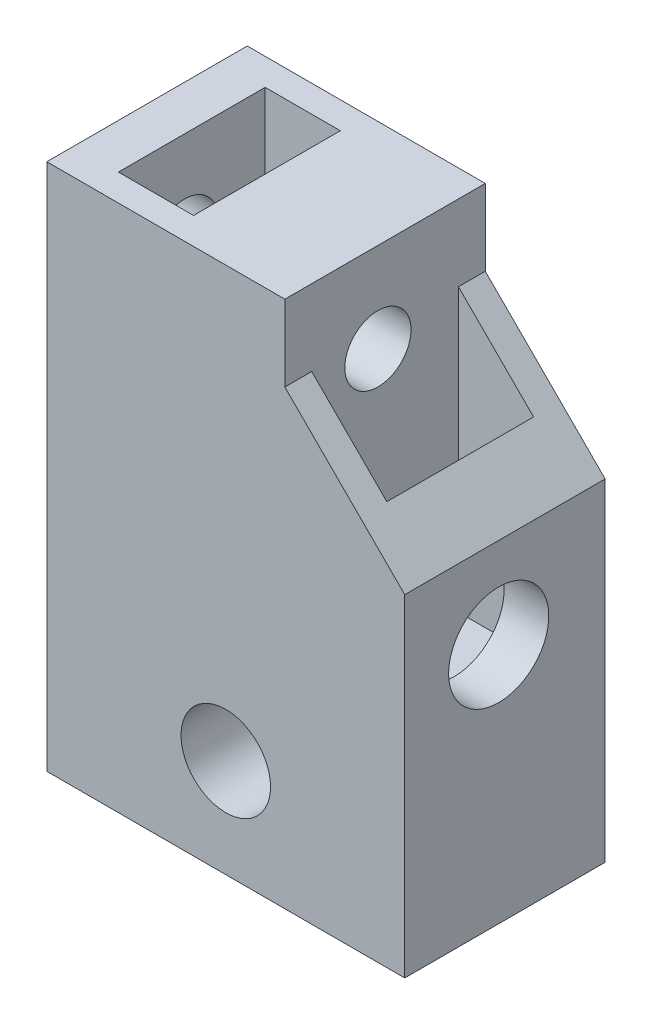
ISO-10303-21;
HEADER;
FILE_DESCRIPTION(('STEP AP214'),'2;1');
FILE_NAME('part.step','',(''),(''),'','','');
FILE_SCHEMA(('AUTOMOTIVE_DESIGN { 1 0 10303 214 1 1 1 1 }'));
ENDSEC;
DATA;
#1=APPLICATION_CONTEXT('core data for automotive mechanical design processes');
#2=APPLICATION_PROTOCOL_DEFINITION('international standard','automotive_design',2000,#1);
#3=PRODUCT_CONTEXT('',#1,'mechanical');
#4=PRODUCT('Part','Part','',(#3));
#5=PRODUCT_RELATED_PRODUCT_CATEGORY('part','',(#4));
#6=PRODUCT_DEFINITION_FORMATION('','',#4);
#7=PRODUCT_DEFINITION_CONTEXT('part definition',#1,'design');
#8=PRODUCT_DEFINITION('design','',#6,#7);
#9=PRODUCT_DEFINITION_SHAPE('','',#8);
#10=(LENGTH_UNIT() NAMED_UNIT(*) SI_UNIT(.MILLI.,.METRE.));
#11=(NAMED_UNIT(*) PLANE_ANGLE_UNIT() SI_UNIT($,.RADIAN.));
#12=(NAMED_UNIT(*) SI_UNIT($,.STERADIAN.) SOLID_ANGLE_UNIT());
#13=UNCERTAINTY_MEASURE_WITH_UNIT(LENGTH_MEASURE(1.E-05),#10,'distance_accuracy_value','');
#14=(GEOMETRIC_REPRESENTATION_CONTEXT(3) GLOBAL_UNCERTAINTY_ASSIGNED_CONTEXT((#13)) GLOBAL_UNIT_ASSIGNED_CONTEXT((#10,
#11,#12)) REPRESENTATION_CONTEXT('',''));
#15=CARTESIAN_POINT('',(0.,0.,0.));
#16=DIRECTION('',(0.,0.,1.));
#17=DIRECTION('',(1.,0.,0.));
#18=AXIS2_PLACEMENT_3D('',#15,#16,#17);
#19=CARTESIAN_POINT('',(0.,29.5,0.));
#20=DIRECTION('',(0.,1.,0.));
#21=DIRECTION('',(0.,0.,1.));
#22=AXIS2_PLACEMENT_3D('',#19,#20,#21);
#23=PLANE('',#22);
#24=DIRECTION('',(0.,0.,1.));
#25=VECTOR('',#24,1.);
#26=CARTESIAN_POINT('',(2.5,29.5,-9.7));
#27=LINE('',#26,#25);
#28=CARTESIAN_POINT('',(2.5,29.5,-9.7));
#29=VERTEX_POINT('',#28);
#30=CARTESIAN_POINT('',(2.5,29.5,-1.5));
#31=VERTEX_POINT('',#30);
#32=EDGE_CURVE('E199',#29,#31,#27,.T.);
#33=ORIENTED_EDGE('',*,*,#32,.F.);
#34=DIRECTION('',(-1.,0.,0.));
#35=VECTOR('',#34,1.);
#36=CARTESIAN_POINT('',(2.5,29.5,-9.7));
#37=LINE('',#36,#35);
#38=CARTESIAN_POINT('',(6.7,29.5,-9.7));
#39=VERTEX_POINT('',#38);
#40=EDGE_CURVE('E248',#39,#29,#37,.T.);
#41=ORIENTED_EDGE('',*,*,#40,.F.);
#42=DIRECTION('',(0.,0.,-1.));
#43=VECTOR('',#42,1.);
#44=CARTESIAN_POINT('',(6.7,29.5,-9.7));
#45=LINE('',#44,#43);
#46=CARTESIAN_POINT('',(6.7,29.5,-1.5));
#47=VERTEX_POINT('',#46);
#48=EDGE_CURVE('E262',#47,#39,#45,.T.);
#49=ORIENTED_EDGE('',*,*,#48,.F.);
#50=DIRECTION('',(1.,0.,0.));
#51=VECTOR('',#50,1.);
#52=CARTESIAN_POINT('',(2.5,29.5,-1.5));
#53=LINE('',#52,#51);
#54=EDGE_CURVE('E259',#31,#47,#53,.T.);
#55=ORIENTED_EDGE('',*,*,#54,.F.);
#56=EDGE_LOOP('',(#33,#41,#49,#55));
#57=FACE_BOUND('',#56,.T.);
#58=DIRECTION('',(1.,0.,0.));
#59=VECTOR('',#58,1.);
#60=CARTESIAN_POINT('',(0.,29.5,0.));
#61=LINE('',#60,#59);
#62=CARTESIAN_POINT('',(0.,29.5,0.));
#63=VERTEX_POINT('',#62);
#64=CARTESIAN_POINT('',(13.3,29.5,0.));
#65=VERTEX_POINT('',#64);
#66=EDGE_CURVE('E148',#63,#65,#61,.T.);
#67=ORIENTED_EDGE('',*,*,#66,.T.);
#68=DIRECTION('',(0.,0.,1.));
#69=VECTOR('',#68,1.);
#70=CARTESIAN_POINT('',(13.3,29.5,-9.7));
#71=LINE('',#70,#69);
#72=CARTESIAN_POINT('',(13.3,29.5,-11.2));
#73=VERTEX_POINT('',#72);
#74=EDGE_CURVE('E128',#73,#65,#71,.T.);
#75=ORIENTED_EDGE('',*,*,#74,.F.);
#76=DIRECTION('',(-1.,0.,0.));
#77=VECTOR('',#76,1.);
#78=CARTESIAN_POINT('',(0.,29.5,-11.2));
#79=LINE('',#78,#77);
#80=CARTESIAN_POINT('',(0.,29.5,-11.2));
#81=VERTEX_POINT('',#80);
#82=EDGE_CURVE('E155',#73,#81,#79,.T.);
#83=ORIENTED_EDGE('',*,*,#82,.T.);
#84=DIRECTION('',(0.,0.,1.));
#85=VECTOR('',#84,1.);
#86=CARTESIAN_POINT('',(0.,29.5,0.));
#87=LINE('',#86,#85);
#88=EDGE_CURVE('E153',#81,#63,#87,.T.);
#89=ORIENTED_EDGE('',*,*,#88,.T.);
#90=EDGE_LOOP('',(#67,#75,#83,#89));
#91=FACE_BOUND('',#90,.T.);
#92=ADVANCED_FACE('F32',(#57,#91),#23,.T.);
#93=CARTESIAN_POINT('',(20.,13.5,-5.25));
#94=DIRECTION('',(-1.,0.,0.));
#95=DIRECTION('',(0.,0.,1.));
#96=AXIS2_PLACEMENT_3D('',#93,#94,#95);
#97=CYLINDRICAL_SURFACE('',#96,2.8);
#98=CARTESIAN_POINT('',(13.3,13.5,-5.25));
#99=DIRECTION('',(-1.,0.,0.));
#100=DIRECTION('',(0.,0.,1.));
#101=AXIS2_PLACEMENT_3D('',#98,#99,#100);
#102=CIRCLE('',#101,2.8);
#103=CARTESIAN_POINT('',(13.3,13.5,-2.45));
#104=VERTEX_POINT('',#103);
#105=EDGE_CURVE('E195',#104,#104,#102,.F.);
#106=ORIENTED_EDGE('',*,*,#105,.T.);
#107=EDGE_LOOP('',(#106));
#108=FACE_BOUND('',#107,.T.);
#109=CARTESIAN_POINT('',(6.7,13.5,-5.25));
#110=DIRECTION('',(1.,0.,0.));
#111=DIRECTION('',(0.,0.,-1.));
#112=AXIS2_PLACEMENT_3D('',#109,#110,#111);
#113=CIRCLE('',#112,2.8);
#114=CARTESIAN_POINT('',(6.7,13.5,-8.05));
#115=VERTEX_POINT('',#114);
#116=EDGE_CURVE('E184',#115,#115,#113,.F.);
#117=ORIENTED_EDGE('',*,*,#116,.T.);
#118=EDGE_LOOP('',(#117));
#119=FACE_BOUND('',#118,.T.);
#120=ADVANCED_FACE('F296',(#108,#119),#97,.F.);
#121=CARTESIAN_POINT('',(2.5,13.5,-5.25));
#122=DIRECTION('',(-1.,0.,0.));
#123=DIRECTION('',(0.,0.,1.));
#124=AXIS2_PLACEMENT_3D('',#121,#122,#123);
#125=CIRCLE('',#124,2.8);
#126=CARTESIAN_POINT('',(2.5,13.5,-2.45));
#127=VERTEX_POINT('',#126);
#128=EDGE_CURVE('E187',#127,#127,#125,.F.);
#129=ORIENTED_EDGE('',*,*,#128,.T.);
#130=EDGE_LOOP('',(#129));
#131=FACE_BOUND('',#130,.T.);
#132=CARTESIAN_POINT('',(0.,13.5,-5.25));
#133=DIRECTION('',(-1.,0.,0.));
#134=DIRECTION('',(0.,0.,1.));
#135=AXIS2_PLACEMENT_3D('',#132,#133,#134);
#136=CIRCLE('',#135,2.8);
#137=CARTESIAN_POINT('',(0.,13.5,-2.45));
#138=VERTEX_POINT('',#137);
#139=EDGE_CURVE('E191',#138,#138,#136,.T.);
#140=ORIENTED_EDGE('',*,*,#139,.T.);
#141=EDGE_LOOP('',(#140));
#142=FACE_BOUND('',#141,.T.);
#143=ADVANCED_FACE('F288',(#131,#142),#97,.F.);
#144=CARTESIAN_POINT('',(0.,29.5,0.));
#145=DIRECTION('',(0.,0.,-1.));
#146=DIRECTION('',(-1.,0.,0.));
#147=AXIS2_PLACEMENT_3D('',#144,#145,#146);
#148=PLANE('',#147);
#149=CARTESIAN_POINT('',(10.,5.5,0.));
#150=DIRECTION('',(0.,0.,1.));
#151=DIRECTION('',(1.,0.,0.));
#152=AXIS2_PLACEMENT_3D('',#149,#150,#151);
#153=CIRCLE('',#152,2.5);
#154=CARTESIAN_POINT('',(12.5,5.5,0.));
#155=VERTEX_POINT('',#154);
#156=EDGE_CURVE('E162',#155,#155,#153,.T.);
#157=ORIENTED_EDGE('',*,*,#156,.F.);
#158=EDGE_LOOP('',(#157));
#159=FACE_BOUND('',#158,.T.);
#160=DIRECTION('',(0.,-1.,0.));
#161=VECTOR('',#160,1.);
#162=CARTESIAN_POINT('',(20.,29.5,0.));
#163=LINE('',#162,#161);
#164=CARTESIAN_POINT('',(20.,18.55,0.));
#165=VERTEX_POINT('',#164);
#166=CARTESIAN_POINT('',(20.,0.,0.));
#167=VERTEX_POINT('',#166);
#168=EDGE_CURVE('E181',#165,#167,#163,.T.);
#169=ORIENTED_EDGE('',*,*,#168,.F.);
#170=DIRECTION('',(0.707106781186544,-0.707106781186551,0.));
#171=VECTOR('',#170,1.);
#172=CARTESIAN_POINT('',(4.52500000000013,34.0250000000001,0.));
#173=LINE('',#172,#171);
#174=CARTESIAN_POINT('',(13.3,25.2500000000001,0.));
#175=VERTEX_POINT('',#174);
#176=EDGE_CURVE('E150',#165,#175,#173,.F.);
#177=ORIENTED_EDGE('',*,*,#176,.T.);
#178=DIRECTION('',(0.,-1.,0.));
#179=VECTOR('',#178,1.);
#180=CARTESIAN_POINT('',(13.3,29.5,0.));
#181=LINE('',#180,#179);
#182=EDGE_CURVE('E133',#65,#175,#181,.T.);
#183=ORIENTED_EDGE('',*,*,#182,.F.);
#184=ORIENTED_EDGE('',*,*,#66,.F.);
#185=DIRECTION('',(0.,-1.,0.));
#186=VECTOR('',#185,1.);
#187=CARTESIAN_POINT('',(0.,29.5,0.));
#188=LINE('',#187,#186);
#189=CARTESIAN_POINT('',(0.,0.,0.));
#190=VERTEX_POINT('',#189);
#191=EDGE_CURVE('E166',#63,#190,#188,.T.);
#192=ORIENTED_EDGE('',*,*,#191,.T.);
#193=DIRECTION('',(1.,0.,0.));
#194=VECTOR('',#193,1.);
#195=CARTESIAN_POINT('',(0.,0.,0.));
#196=LINE('',#195,#194);
#197=EDGE_CURVE('E167',#190,#167,#196,.T.);
#198=ORIENTED_EDGE('',*,*,#197,.T.);
#199=EDGE_LOOP('',(#169,#177,#183,#184,#192,#198));
#200=FACE_BOUND('',#199,.T.);
#201=ADVANCED_FACE('F146',(#159,#200),#148,.F.);
#202=CARTESIAN_POINT('',(20.,29.5,0.));
#203=DIRECTION('',(-1.,0.,0.));
#204=DIRECTION('',(0.,0.,1.));
#205=AXIS2_PLACEMENT_3D('',#202,#203,#204);
#206=PLANE('',#205);
#207=CARTESIAN_POINT('',(20.,13.5,-5.25));
#208=DIRECTION('',(-1.,0.,0.));
#209=DIRECTION('',(0.,0.,1.));
#210=AXIS2_PLACEMENT_3D('',#207,#208,#209);
#211=CIRCLE('',#210,2.8);
#212=CARTESIAN_POINT('',(20.,13.5,-2.45));
#213=VERTEX_POINT('',#212);
#214=EDGE_CURVE('E274',#213,#213,#211,.T.);
#215=ORIENTED_EDGE('',*,*,#214,.T.);
#216=EDGE_LOOP('',(#215));
#217=FACE_BOUND('',#216,.T.);
#218=DIRECTION('',(0.,-1.,0.));
#219=VECTOR('',#218,1.);
#220=CARTESIAN_POINT('',(20.,29.5,-11.2));
#221=LINE('',#220,#219);
#222=CARTESIAN_POINT('',(20.,18.55,-11.2));
#223=VERTEX_POINT('',#222);
#224=CARTESIAN_POINT('',(20.,0.,-11.2));
#225=VERTEX_POINT('',#224);
#226=EDGE_CURVE('E179',#223,#225,#221,.T.);
#227=ORIENTED_EDGE('',*,*,#226,.F.);
#228=DIRECTION('',(0.,0.,-1.));
#229=VECTOR('',#228,1.);
#230=CARTESIAN_POINT('',(20.,18.55,0.));
#231=LINE('',#230,#229);
#232=EDGE_CURVE('E206',#223,#165,#231,.F.);
#233=ORIENTED_EDGE('',*,*,#232,.T.);
#234=ORIENTED_EDGE('',*,*,#168,.T.);
#235=DIRECTION('',(0.,0.,-1.));
#236=VECTOR('',#235,1.);
#237=CARTESIAN_POINT('',(20.,0.,0.));
#238=LINE('',#237,#236);
#239=EDGE_CURVE('E170',#167,#225,#238,.T.);
#240=ORIENTED_EDGE('',*,*,#239,.T.);
#241=EDGE_LOOP('',(#227,#233,#234,#240));
#242=FACE_BOUND('',#241,.T.);
#243=ADVANCED_FACE('F287',(#217,#242),#206,.F.);
#244=CARTESIAN_POINT('',(0.,29.5,-11.2));
#245=DIRECTION('',(0.,0.,1.));
#246=DIRECTION('',(1.,0.,0.));
#247=AXIS2_PLACEMENT_3D('',#244,#245,#246);
#248=PLANE('',#247);
#249=CARTESIAN_POINT('',(10.,5.5,-11.2));
#250=DIRECTION('',(0.,0.,1.));
#251=DIRECTION('',(1.,0.,0.));
#252=AXIS2_PLACEMENT_3D('',#249,#250,#251);
#253=CIRCLE('',#252,2.5);
#254=CARTESIAN_POINT('',(12.5,5.5,-11.2));
#255=VERTEX_POINT('',#254);
#256=EDGE_CURVE('E171',#255,#255,#253,.T.);
#257=ORIENTED_EDGE('',*,*,#256,.T.);
#258=EDGE_LOOP('',(#257));
#259=FACE_BOUND('',#258,.T.);
#260=DIRECTION('',(0.,1.,0.));
#261=VECTOR('',#260,1.);
#262=CARTESIAN_POINT('',(13.3,29.5,-11.2));
#263=LINE('',#262,#261);
#264=CARTESIAN_POINT('',(13.3,25.2500000000001,-11.2));
#265=VERTEX_POINT('',#264);
#266=EDGE_CURVE('E137',#265,#73,#263,.T.);
#267=ORIENTED_EDGE('',*,*,#266,.F.);
#268=DIRECTION('',(-0.707106781186544,0.707106781186551,0.));
#269=VECTOR('',#268,1.);
#270=CARTESIAN_POINT('',(4.52500000000013,34.0250000000001,-11.2));
#271=LINE('',#270,#269);
#272=EDGE_CURVE('E203',#265,#223,#271,.F.);
#273=ORIENTED_EDGE('',*,*,#272,.T.);
#274=ORIENTED_EDGE('',*,*,#226,.T.);
#275=DIRECTION('',(-1.,0.,0.));
#276=VECTOR('',#275,1.);
#277=CARTESIAN_POINT('',(0.,0.,-11.2));
#278=LINE('',#277,#276);
#279=CARTESIAN_POINT('',(0.,0.,-11.2));
#280=VERTEX_POINT('',#279);
#281=EDGE_CURVE('E159',#225,#280,#278,.T.);
#282=ORIENTED_EDGE('',*,*,#281,.T.);
#283=DIRECTION('',(0.,-1.,0.));
#284=VECTOR('',#283,1.);
#285=CARTESIAN_POINT('',(0.,29.5,-11.2));
#286=LINE('',#285,#284);
#287=EDGE_CURVE('E176',#81,#280,#286,.T.);
#288=ORIENTED_EDGE('',*,*,#287,.F.);
#289=ORIENTED_EDGE('',*,*,#82,.F.);
#290=EDGE_LOOP('',(#267,#273,#274,#282,#288,#289));
#291=FACE_BOUND('',#290,.T.);
#292=ADVANCED_FACE('F293',(#259,#291),#248,.F.);
#293=CARTESIAN_POINT('',(0.,29.5,0.));
#294=DIRECTION('',(1.,0.,0.));
#295=DIRECTION('',(0.,0.,-1.));
#296=AXIS2_PLACEMENT_3D('',#293,#294,#295);
#297=PLANE('',#296);
#298=CARTESIAN_POINT('',(0.,24.5,-5.2));
#299=DIRECTION('',(1.,0.,0.));
#300=DIRECTION('',(0.,0.,-1.));
#301=AXIS2_PLACEMENT_3D('',#298,#299,#300);
#302=CIRCLE('',#301,1.85);
#303=CARTESIAN_POINT('',(0.,24.5,-7.05));
#304=VERTEX_POINT('',#303);
#305=EDGE_CURVE('E324',#304,#304,#302,.T.);
#306=ORIENTED_EDGE('',*,*,#305,.T.);
#307=EDGE_LOOP('',(#306));
#308=FACE_BOUND('',#307,.T.);
#309=ORIENTED_EDGE('',*,*,#139,.F.);
#310=EDGE_LOOP('',(#309));
#311=FACE_BOUND('',#310,.T.);
#312=DIRECTION('',(0.,0.,1.));
#313=VECTOR('',#312,1.);
#314=CARTESIAN_POINT('',(0.,0.,0.));
#315=LINE('',#314,#313);
#316=EDGE_CURVE('E156',#280,#190,#315,.T.);
#317=ORIENTED_EDGE('',*,*,#316,.T.);
#318=ORIENTED_EDGE('',*,*,#191,.F.);
#319=ORIENTED_EDGE('',*,*,#88,.F.);
#320=ORIENTED_EDGE('',*,*,#287,.T.);
#321=EDGE_LOOP('',(#317,#318,#319,#320));
#322=FACE_BOUND('',#321,.T.);
#323=ADVANCED_FACE('F313',(#308,#311,#322),#297,.F.);
#324=CARTESIAN_POINT('',(0.,0.,0.));
#325=DIRECTION('',(0.,1.,0.));
#326=DIRECTION('',(0.,0.,1.));
#327=AXIS2_PLACEMENT_3D('',#324,#325,#326);
#328=PLANE('',#327);
#329=ORIENTED_EDGE('',*,*,#197,.F.);
#330=ORIENTED_EDGE('',*,*,#316,.F.);
#331=ORIENTED_EDGE('',*,*,#281,.F.);
#332=ORIENTED_EDGE('',*,*,#239,.F.);
#333=EDGE_LOOP('',(#329,#330,#331,#332));
#334=FACE_BOUND('',#333,.T.);
#335=ADVANCED_FACE('F310',(#334),#328,.F.);
#336=CARTESIAN_POINT('',(10.,5.5,-11.2));
#337=DIRECTION('',(0.,0.,1.));
#338=DIRECTION('',(1.,0.,0.));
#339=AXIS2_PLACEMENT_3D('',#336,#337,#338);
#340=CYLINDRICAL_SURFACE('',#339,2.5);
#341=ORIENTED_EDGE('',*,*,#256,.F.);
#342=EDGE_LOOP('',(#341));
#343=FACE_BOUND('',#342,.T.);
#344=ORIENTED_EDGE('',*,*,#156,.T.);
#345=EDGE_LOOP('',(#344));
#346=FACE_BOUND('',#345,.T.);
#347=ADVANCED_FACE('F284',(#343,#346),#340,.F.);
#348=CARTESIAN_POINT('',(17.5,13.5,-5.25));
#349=DIRECTION('',(1.,0.,0.));
#350=DIRECTION('',(0.,0.,-1.));
#351=AXIS2_PLACEMENT_3D('',#348,#349,#350);
#352=CIRCLE('',#351,2.8);
#353=CARTESIAN_POINT('',(17.5,13.5,-8.05));
#354=VERTEX_POINT('',#353);
#355=EDGE_CURVE('E192',#354,#354,#352,.F.);
#356=ORIENTED_EDGE('',*,*,#355,.T.);
#357=EDGE_LOOP('',(#356));
#358=FACE_BOUND('',#357,.T.);
#359=ORIENTED_EDGE('',*,*,#214,.F.);
#360=EDGE_LOOP('',(#359));
#361=FACE_BOUND('',#360,.T.);
#362=ADVANCED_FACE('F299',(#358,#361),#97,.F.);
#363=CARTESIAN_POINT('',(2.5,9.5,-9.7));
#364=DIRECTION('',(-1.,0.,0.));
#365=DIRECTION('',(0.,0.,1.));
#366=AXIS2_PLACEMENT_3D('',#363,#364,#365);
#367=PLANE('',#366);
#368=CARTESIAN_POINT('',(2.5,24.5,-5.2));
#369=DIRECTION('',(-1.,0.,0.));
#370=DIRECTION('',(0.,0.,1.));
#371=AXIS2_PLACEMENT_3D('',#368,#369,#370);
#372=CIRCLE('',#371,1.85);
#373=CARTESIAN_POINT('',(2.5,24.5,-3.35));
#374=VERTEX_POINT('',#373);
#375=EDGE_CURVE('E142',#374,#374,#372,.T.);
#376=ORIENTED_EDGE('',*,*,#375,.T.);
#377=EDGE_LOOP('',(#376));
#378=FACE_BOUND('',#377,.T.);
#379=ORIENTED_EDGE('',*,*,#32,.T.);
#380=DIRECTION('',(0.,1.,0.));
#381=VECTOR('',#380,1.);
#382=CARTESIAN_POINT('',(2.5,9.5,-1.5));
#383=LINE('',#382,#381);
#384=CARTESIAN_POINT('',(2.5,9.5,-1.5));
#385=VERTEX_POINT('',#384);
#386=EDGE_CURVE('E257',#385,#31,#383,.T.);
#387=ORIENTED_EDGE('',*,*,#386,.F.);
#388=DIRECTION('',(0.,0.,1.));
#389=VECTOR('',#388,1.);
#390=CARTESIAN_POINT('',(2.5,9.5,-9.7));
#391=LINE('',#390,#389);
#392=CARTESIAN_POINT('',(2.5,9.5,-9.7));
#393=VERTEX_POINT('',#392);
#394=EDGE_CURVE('E244',#393,#385,#391,.T.);
#395=ORIENTED_EDGE('',*,*,#394,.F.);
#396=DIRECTION('',(0.,1.,0.));
#397=VECTOR('',#396,1.);
#398=CARTESIAN_POINT('',(2.5,9.5,-9.7));
#399=LINE('',#398,#397);
#400=EDGE_CURVE('E188',#393,#29,#399,.T.);
#401=ORIENTED_EDGE('',*,*,#400,.T.);
#402=EDGE_LOOP('',(#379,#387,#395,#401));
#403=FACE_BOUND('',#402,.T.);
#404=ORIENTED_EDGE('',*,*,#128,.F.);
#405=EDGE_LOOP('',(#404));
#406=FACE_BOUND('',#405,.T.);
#407=ADVANCED_FACE('F370',(#378,#403,#406),#367,.F.);
#408=CARTESIAN_POINT('',(6.7,9.5,-9.7));
#409=DIRECTION('',(1.,0.,0.));
#410=DIRECTION('',(0.,0.,-1.));
#411=AXIS2_PLACEMENT_3D('',#408,#409,#410);
#412=PLANE('',#411);
#413=CARTESIAN_POINT('',(6.7,24.5,-5.2));
#414=DIRECTION('',(1.,0.,0.));
#415=DIRECTION('',(0.,0.,-1.));
#416=AXIS2_PLACEMENT_3D('',#413,#414,#415);
#417=CIRCLE('',#416,1.85);
#418=CARTESIAN_POINT('',(6.7,24.5,-7.05));
#419=VERTEX_POINT('',#418);
#420=EDGE_CURVE('E332',#419,#419,#417,.T.);
#421=ORIENTED_EDGE('',*,*,#420,.T.);
#422=EDGE_LOOP('',(#421));
#423=FACE_BOUND('',#422,.T.);
#424=ORIENTED_EDGE('',*,*,#48,.T.);
#425=DIRECTION('',(0.,1.,0.));
#426=VECTOR('',#425,1.);
#427=CARTESIAN_POINT('',(6.7,9.5,-9.7));
#428=LINE('',#427,#426);
#429=CARTESIAN_POINT('',(6.7,9.5,-9.7));
#430=VERTEX_POINT('',#429);
#431=EDGE_CURVE('E268',#430,#39,#428,.T.);
#432=ORIENTED_EDGE('',*,*,#431,.F.);
#433=DIRECTION('',(0.,0.,-1.));
#434=VECTOR('',#433,1.);
#435=CARTESIAN_POINT('',(6.7,9.5,-9.7));
#436=LINE('',#435,#434);
#437=CARTESIAN_POINT('',(6.7,9.5,-1.5));
#438=VERTEX_POINT('',#437);
#439=EDGE_CURVE('E251',#438,#430,#436,.T.);
#440=ORIENTED_EDGE('',*,*,#439,.F.);
#441=DIRECTION('',(0.,1.,0.));
#442=VECTOR('',#441,1.);
#443=CARTESIAN_POINT('',(6.7,9.5,-1.5));
#444=LINE('',#443,#442);
#445=EDGE_CURVE('E270',#438,#47,#444,.T.);
#446=ORIENTED_EDGE('',*,*,#445,.T.);
#447=EDGE_LOOP('',(#424,#432,#440,#446));
#448=FACE_BOUND('',#447,.T.);
#449=ORIENTED_EDGE('',*,*,#116,.F.);
#450=EDGE_LOOP('',(#449));
#451=FACE_BOUND('',#450,.T.);
#452=ADVANCED_FACE('F366',(#423,#448,#451),#412,.F.);
#453=CARTESIAN_POINT('',(2.5,9.5,-9.7));
#454=DIRECTION('',(0.,0.,-1.));
#455=DIRECTION('',(-1.,0.,0.));
#456=AXIS2_PLACEMENT_3D('',#453,#454,#455);
#457=PLANE('',#456);
#458=ORIENTED_EDGE('',*,*,#40,.T.);
#459=ORIENTED_EDGE('',*,*,#400,.F.);
#460=DIRECTION('',(-1.,0.,0.));
#461=VECTOR('',#460,1.);
#462=CARTESIAN_POINT('',(2.5,9.5,-9.7));
#463=LINE('',#462,#461);
#464=EDGE_CURVE('E254',#430,#393,#463,.T.);
#465=ORIENTED_EDGE('',*,*,#464,.F.);
#466=ORIENTED_EDGE('',*,*,#431,.T.);
#467=EDGE_LOOP('',(#458,#459,#465,#466));
#468=FACE_BOUND('',#467,.T.);
#469=ADVANCED_FACE('F363',(#468),#457,.F.);
#470=CARTESIAN_POINT('',(2.5,9.5,-1.5));
#471=DIRECTION('',(0.,0.,1.));
#472=DIRECTION('',(1.,0.,0.));
#473=AXIS2_PLACEMENT_3D('',#470,#471,#472);
#474=PLANE('',#473);
#475=ORIENTED_EDGE('',*,*,#54,.T.);
#476=ORIENTED_EDGE('',*,*,#445,.F.);
#477=DIRECTION('',(1.,0.,0.));
#478=VECTOR('',#477,1.);
#479=CARTESIAN_POINT('',(2.5,9.5,-1.5));
#480=LINE('',#479,#478);
#481=EDGE_CURVE('E247',#385,#438,#480,.T.);
#482=ORIENTED_EDGE('',*,*,#481,.F.);
#483=ORIENTED_EDGE('',*,*,#386,.T.);
#484=EDGE_LOOP('',(#475,#476,#482,#483));
#485=FACE_BOUND('',#484,.T.);
#486=ADVANCED_FACE('F361',(#485),#474,.F.);
#487=CARTESIAN_POINT('',(0.,9.5,0.));
#488=DIRECTION('',(0.,1.,0.));
#489=DIRECTION('',(0.,0.,1.));
#490=AXIS2_PLACEMENT_3D('',#487,#488,#489);
#491=PLANE('',#490);
#492=ORIENTED_EDGE('',*,*,#394,.T.);
#493=ORIENTED_EDGE('',*,*,#481,.T.);
#494=ORIENTED_EDGE('',*,*,#439,.T.);
#495=ORIENTED_EDGE('',*,*,#464,.T.);
#496=EDGE_LOOP('',(#492,#493,#494,#495));
#497=FACE_BOUND('',#496,.T.);
#498=ADVANCED_FACE('F358',(#497),#491,.T.);
#499=CARTESIAN_POINT('',(13.3,9.5,-9.7));
#500=DIRECTION('',(-1.,0.,0.));
#501=DIRECTION('',(0.,0.,1.));
#502=AXIS2_PLACEMENT_3D('',#499,#500,#501);
#503=PLANE('',#502);
#504=DIRECTION('',(0.,1.,0.));
#505=VECTOR('',#504,1.);
#506=CARTESIAN_POINT('',(13.3,9.5,-9.7));
#507=LINE('',#506,#505);
#508=CARTESIAN_POINT('',(13.3,9.5,-9.7));
#509=VERTEX_POINT('',#508);
#510=CARTESIAN_POINT('',(13.3,25.2500000000001,-9.7));
#511=VERTEX_POINT('',#510);
#512=EDGE_CURVE('E196',#509,#511,#507,.T.);
#513=ORIENTED_EDGE('',*,*,#512,.T.);
#514=DIRECTION('',(0.,0.,-1.));
#515=VECTOR('',#514,1.);
#516=CARTESIAN_POINT('',(13.3,25.2500000000001,-11.2));
#517=LINE('',#516,#515);
#518=EDGE_CURVE('E201',#511,#265,#517,.T.);
#519=ORIENTED_EDGE('',*,*,#518,.T.);
#520=ORIENTED_EDGE('',*,*,#266,.T.);
#521=ORIENTED_EDGE('',*,*,#74,.T.);
#522=ORIENTED_EDGE('',*,*,#182,.T.);
#523=DIRECTION('',(0.,0.,1.));
#524=VECTOR('',#523,1.);
#525=CARTESIAN_POINT('',(13.3,25.2500000000001,-9.7));
#526=LINE('',#525,#524);
#527=CARTESIAN_POINT('',(13.3,25.2500000000001,-1.5));
#528=VERTEX_POINT('',#527);
#529=EDGE_CURVE('E183',#175,#528,#526,.F.);
#530=ORIENTED_EDGE('',*,*,#529,.T.);
#531=DIRECTION('',(0.,1.,0.));
#532=VECTOR('',#531,1.);
#533=CARTESIAN_POINT('',(13.3,9.5,-1.5));
#534=LINE('',#533,#532);
#535=CARTESIAN_POINT('',(13.3,9.5,-1.5));
#536=VERTEX_POINT('',#535);
#537=EDGE_CURVE('E229',#536,#528,#534,.T.);
#538=ORIENTED_EDGE('',*,*,#537,.F.);
#539=DIRECTION('',(0.,0.,1.));
#540=VECTOR('',#539,1.);
#541=CARTESIAN_POINT('',(13.3,9.5,-9.7));
#542=LINE('',#541,#540);
#543=EDGE_CURVE('E141',#509,#536,#542,.T.);
#544=ORIENTED_EDGE('',*,*,#543,.F.);
#545=EDGE_LOOP('',(#513,#519,#520,#521,#522,#530,#538,#544));
#546=FACE_BOUND('',#545,.T.);
#547=ORIENTED_EDGE('',*,*,#105,.F.);
#548=EDGE_LOOP('',(#547));
#549=FACE_BOUND('',#548,.T.);
#550=CARTESIAN_POINT('',(13.3,24.5,-5.2));
#551=DIRECTION('',(-1.,0.,0.));
#552=DIRECTION('',(0.,0.,1.));
#553=AXIS2_PLACEMENT_3D('',#550,#551,#552);
#554=CIRCLE('',#553,1.85);
#555=CARTESIAN_POINT('',(13.3,24.5,-3.35));
#556=VERTEX_POINT('',#555);
#557=EDGE_CURVE('E327',#556,#556,#554,.T.);
#558=ORIENTED_EDGE('',*,*,#557,.T.);
#559=EDGE_LOOP('',(#558));
#560=FACE_BOUND('',#559,.T.);
#561=ADVANCED_FACE('F130',(#546,#549,#560),#503,.F.);
#562=CARTESIAN_POINT('',(17.5,9.5,-9.7));
#563=DIRECTION('',(1.,0.,0.));
#564=DIRECTION('',(0.,0.,-1.));
#565=AXIS2_PLACEMENT_3D('',#562,#563,#564);
#566=PLANE('',#565);
#567=DIRECTION('',(0.,1.,0.));
#568=VECTOR('',#567,1.);
#569=CARTESIAN_POINT('',(17.5,9.5,-1.5));
#570=LINE('',#569,#568);
#571=CARTESIAN_POINT('',(17.5,9.5,-1.5));
#572=VERTEX_POINT('',#571);
#573=CARTESIAN_POINT('',(17.5,21.0500000000001,-1.5));
#574=VERTEX_POINT('',#573);
#575=EDGE_CURVE('E219',#572,#574,#570,.T.);
#576=ORIENTED_EDGE('',*,*,#575,.T.);
#577=DIRECTION('',(0.,0.,1.));
#578=VECTOR('',#577,1.);
#579=CARTESIAN_POINT('',(17.5,21.0500000000001,-9.7));
#580=LINE('',#579,#578);
#581=CARTESIAN_POINT('',(17.5,21.0500000000001,-9.7));
#582=VERTEX_POINT('',#581);
#583=EDGE_CURVE('E41',#574,#582,#580,.F.);
#584=ORIENTED_EDGE('',*,*,#583,.T.);
#585=DIRECTION('',(0.,1.,0.));
#586=VECTOR('',#585,1.);
#587=CARTESIAN_POINT('',(17.5,9.5,-9.7));
#588=LINE('',#587,#586);
#589=CARTESIAN_POINT('',(17.5,9.5,-9.7));
#590=VERTEX_POINT('',#589);
#591=EDGE_CURVE('E47',#590,#582,#588,.T.);
#592=ORIENTED_EDGE('',*,*,#591,.F.);
#593=DIRECTION('',(0.,0.,-1.));
#594=VECTOR('',#593,1.);
#595=CARTESIAN_POINT('',(17.5,9.5,-9.7));
#596=LINE('',#595,#594);
#597=EDGE_CURVE('E236',#572,#590,#596,.T.);
#598=ORIENTED_EDGE('',*,*,#597,.F.);
#599=EDGE_LOOP('',(#576,#584,#592,#598));
#600=FACE_BOUND('',#599,.T.);
#601=ORIENTED_EDGE('',*,*,#355,.F.);
#602=EDGE_LOOP('',(#601));
#603=FACE_BOUND('',#602,.T.);
#604=ADVANCED_FACE('F215',(#600,#603),#566,.F.);
#605=CARTESIAN_POINT('',(13.3,9.5,-9.7));
#606=DIRECTION('',(0.,0.,-1.));
#607=DIRECTION('',(-1.,0.,0.));
#608=AXIS2_PLACEMENT_3D('',#605,#606,#607);
#609=PLANE('',#608);
#610=ORIENTED_EDGE('',*,*,#591,.T.);
#611=DIRECTION('',(0.707106781186544,-0.707106781186551,0.));
#612=VECTOR('',#611,1.);
#613=CARTESIAN_POINT('',(21.1750000000001,17.375,-9.7));
#614=LINE('',#613,#612);
#615=EDGE_CURVE('E11',#582,#511,#614,.F.);
#616=ORIENTED_EDGE('',*,*,#615,.T.);
#617=ORIENTED_EDGE('',*,*,#512,.F.);
#618=DIRECTION('',(-1.,0.,0.));
#619=VECTOR('',#618,1.);
#620=CARTESIAN_POINT('',(13.3,9.5,-9.7));
#621=LINE('',#620,#619);
#622=EDGE_CURVE('E226',#590,#509,#621,.T.);
#623=ORIENTED_EDGE('',*,*,#622,.F.);
#624=EDGE_LOOP('',(#610,#616,#617,#623));
#625=FACE_BOUND('',#624,.T.);
#626=ADVANCED_FACE('F223',(#625),#609,.F.);
#627=CARTESIAN_POINT('',(13.3,9.5,-1.5));
#628=DIRECTION('',(0.,0.,1.));
#629=DIRECTION('',(1.,0.,0.));
#630=AXIS2_PLACEMENT_3D('',#627,#628,#629);
#631=PLANE('',#630);
#632=ORIENTED_EDGE('',*,*,#537,.T.);
#633=DIRECTION('',(-0.707106781186544,0.707106781186551,0.));
#634=VECTOR('',#633,1.);
#635=CARTESIAN_POINT('',(21.1750000000001,17.375,-1.5));
#636=LINE('',#635,#634);
#637=EDGE_CURVE('E210',#528,#574,#636,.F.);
#638=ORIENTED_EDGE('',*,*,#637,.T.);
#639=ORIENTED_EDGE('',*,*,#575,.F.);
#640=DIRECTION('',(1.,0.,0.));
#641=VECTOR('',#640,1.);
#642=CARTESIAN_POINT('',(13.3,9.5,-1.5));
#643=LINE('',#642,#641);
#644=EDGE_CURVE('E233',#536,#572,#643,.T.);
#645=ORIENTED_EDGE('',*,*,#644,.F.);
#646=EDGE_LOOP('',(#632,#638,#639,#645));
#647=FACE_BOUND('',#646,.T.);
#648=ADVANCED_FACE('F337',(#647),#631,.F.);
#649=CARTESIAN_POINT('',(0.,9.5,0.));
#650=DIRECTION('',(0.,1.,0.));
#651=DIRECTION('',(0.,0.,1.));
#652=AXIS2_PLACEMENT_3D('',#649,#650,#651);
#653=PLANE('',#652);
#654=ORIENTED_EDGE('',*,*,#543,.T.);
#655=ORIENTED_EDGE('',*,*,#644,.T.);
#656=ORIENTED_EDGE('',*,*,#597,.T.);
#657=ORIENTED_EDGE('',*,*,#622,.T.);
#658=EDGE_LOOP('',(#654,#655,#656,#657));
#659=FACE_BOUND('',#658,.T.);
#660=ADVANCED_FACE('F235',(#659),#653,.T.);
#661=CARTESIAN_POINT('',(0.,24.5,-5.2));
#662=DIRECTION('',(1.,0.,0.));
#663=DIRECTION('',(0.,0.,-1.));
#664=AXIS2_PLACEMENT_3D('',#661,#662,#663);
#665=CYLINDRICAL_SURFACE('',#664,1.85);
#666=ORIENTED_EDGE('',*,*,#557,.F.);
#667=EDGE_LOOP('',(#666));
#668=FACE_BOUND('',#667,.T.);
#669=ORIENTED_EDGE('',*,*,#420,.F.);
#670=EDGE_LOOP('',(#669));
#671=FACE_BOUND('',#670,.T.);
#672=ADVANCED_FACE('F351',(#668,#671),#665,.F.);
#673=ORIENTED_EDGE('',*,*,#305,.F.);
#674=EDGE_LOOP('',(#673));
#675=FACE_BOUND('',#674,.T.);
#676=ORIENTED_EDGE('',*,*,#375,.F.);
#677=EDGE_LOOP('',(#676));
#678=FACE_BOUND('',#677,.T.);
#679=ADVANCED_FACE('F408',(#675,#678),#665,.F.);
#680=CARTESIAN_POINT('',(13.3,25.2500000000001,-9.7));
#681=DIRECTION('',(0.707106781186551,0.707106781186544,0.));
#682=DIRECTION('',(0.,0.,1.));
#683=AXIS2_PLACEMENT_3D('',#680,#681,#682);
#684=PLANE('',#683);
#685=ORIENTED_EDGE('',*,*,#176,.F.);
#686=ORIENTED_EDGE('',*,*,#232,.F.);
#687=ORIENTED_EDGE('',*,*,#272,.F.);
#688=ORIENTED_EDGE('',*,*,#518,.F.);
#689=ORIENTED_EDGE('',*,*,#615,.F.);
#690=ORIENTED_EDGE('',*,*,#583,.F.);
#691=ORIENTED_EDGE('',*,*,#637,.F.);
#692=ORIENTED_EDGE('',*,*,#529,.F.);
#693=EDGE_LOOP('',(#685,#686,#687,#688,#689,#690,#691,#692));
#694=FACE_BOUND('',#693,.T.);
#695=ADVANCED_FACE('F34',(#694),#684,.T.);
#696=CLOSED_SHELL('',(#92,#120,#143,#201,#243,#292,#323,#335,#347,#362,#407,#452,#469,#486,#498,
#561,#604,#626,#648,#660,#672,#679,#695));
#697=MANIFOLD_SOLID_BREP('B2',#696);
#698=ADVANCED_BREP_SHAPE_REPRESENTATION('',(#18,#697),#14);
#699=SHAPE_DEFINITION_REPRESENTATION(#9,#698);
ENDSEC;
END-ISO-10303-21;
